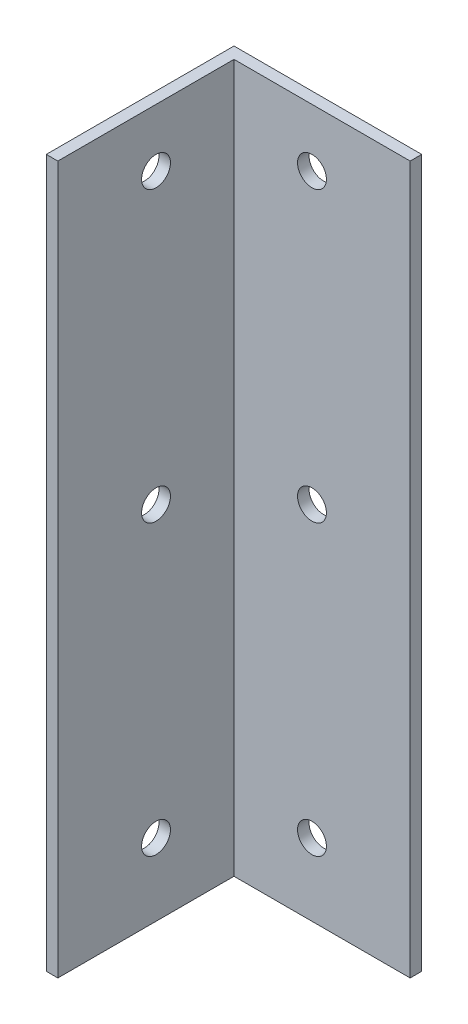
ISO-10303-21;
HEADER;
FILE_DESCRIPTION(('STEP AP214'),'2;1');
FILE_NAME('part.step','',(''),(''),'','','');
FILE_SCHEMA(('AUTOMOTIVE_DESIGN { 1 0 10303 214 1 1 1 1 }'));
ENDSEC;
DATA;
#1=APPLICATION_CONTEXT('core data for automotive mechanical design processes');
#2=APPLICATION_PROTOCOL_DEFINITION('international standard','automotive_design',2000,#1);
#3=PRODUCT_CONTEXT('',#1,'mechanical');
#4=PRODUCT('Part','Part','',(#3));
#5=PRODUCT_RELATED_PRODUCT_CATEGORY('part','',(#4));
#6=PRODUCT_DEFINITION_FORMATION('','',#4);
#7=PRODUCT_DEFINITION_CONTEXT('part definition',#1,'design');
#8=PRODUCT_DEFINITION('design','',#6,#7);
#9=PRODUCT_DEFINITION_SHAPE('','',#8);
#10=(LENGTH_UNIT() NAMED_UNIT(*) SI_UNIT(.MILLI.,.METRE.));
#11=(NAMED_UNIT(*) PLANE_ANGLE_UNIT() SI_UNIT($,.RADIAN.));
#12=(NAMED_UNIT(*) SI_UNIT($,.STERADIAN.) SOLID_ANGLE_UNIT());
#13=UNCERTAINTY_MEASURE_WITH_UNIT(LENGTH_MEASURE(1.E-05),#10,'distance_accuracy_value','');
#14=(GEOMETRIC_REPRESENTATION_CONTEXT(3) GLOBAL_UNCERTAINTY_ASSIGNED_CONTEXT((#13)) GLOBAL_UNIT_ASSIGNED_CONTEXT((#10,
#11,#12)) REPRESENTATION_CONTEXT('',''));
#15=CARTESIAN_POINT('',(0.,0.,0.));
#16=DIRECTION('',(0.,0.,1.));
#17=DIRECTION('',(1.,0.,0.));
#18=AXIS2_PLACEMENT_3D('',#15,#16,#17);
#19=CARTESIAN_POINT('',(4.,245.,0.));
#20=DIRECTION('',(-1.,0.,0.));
#21=DIRECTION('',(0.,0.,-1.));
#22=AXIS2_PLACEMENT_3D('',#19,#20,#21);
#23=PLANE('',#22);
#24=CARTESIAN_POINT('',(4.,125.,30.9999999999961));
#25=DIRECTION('',(1.,0.,0.));
#26=DIRECTION('',(0.,0.,-1.));
#27=AXIS2_PLACEMENT_3D('',#24,#25,#26);
#28=CIRCLE('',#27,4.99999999999999);
#29=CARTESIAN_POINT('',(4.,125.,25.9999999999961));
#30=VERTEX_POINT('',#29);
#31=EDGE_CURVE('E189',#30,#30,#28,.T.);
#32=ORIENTED_EDGE('',*,*,#31,.F.);
#33=EDGE_LOOP('',(#32));
#34=FACE_BOUND('',#33,.T.);
#35=CARTESIAN_POINT('',(4.,25.,30.9999999999922));
#36=DIRECTION('',(1.,0.,0.));
#37=DIRECTION('',(0.,0.,-1.));
#38=AXIS2_PLACEMENT_3D('',#35,#36,#37);
#39=CIRCLE('',#38,5.);
#40=CARTESIAN_POINT('',(4.,25.,25.9999999999922));
#41=VERTEX_POINT('',#40);
#42=EDGE_CURVE('E193',#41,#41,#39,.T.);
#43=ORIENTED_EDGE('',*,*,#42,.F.);
#44=EDGE_LOOP('',(#43));
#45=FACE_BOUND('',#44,.T.);
#46=CARTESIAN_POINT('',(4.,225.,31.));
#47=DIRECTION('',(1.,0.,0.));
#48=DIRECTION('',(0.,0.,-1.));
#49=AXIS2_PLACEMENT_3D('',#46,#47,#48);
#50=CIRCLE('',#49,5.);
#51=CARTESIAN_POINT('',(4.,225.,26.));
#52=VERTEX_POINT('',#51);
#53=EDGE_CURVE('E153',#52,#52,#50,.T.);
#54=ORIENTED_EDGE('',*,*,#53,.F.);
#55=EDGE_LOOP('',(#54));
#56=FACE_BOUND('',#55,.T.);
#57=DIRECTION('',(0.,0.,1.));
#58=VECTOR('',#57,1.);
#59=CARTESIAN_POINT('',(4.,0.,0.));
#60=LINE('',#59,#58);
#61=CARTESIAN_POINT('',(4.,0.,4.));
#62=VERTEX_POINT('',#61);
#63=CARTESIAN_POINT('',(4.,0.,65.));
#64=VERTEX_POINT('',#63);
#65=EDGE_CURVE('E122',#62,#64,#60,.T.);
#66=ORIENTED_EDGE('',*,*,#65,.F.);
#67=DIRECTION('',(0.,-1.,0.));
#68=VECTOR('',#67,1.);
#69=CARTESIAN_POINT('',(4.,245.,4.));
#70=LINE('',#69,#68);
#71=CARTESIAN_POINT('',(4.,245.,4.));
#72=VERTEX_POINT('',#71);
#73=EDGE_CURVE('E121',#72,#62,#70,.T.);
#74=ORIENTED_EDGE('',*,*,#73,.F.);
#75=DIRECTION('',(0.,0.,1.));
#76=VECTOR('',#75,1.);
#77=CARTESIAN_POINT('',(4.,245.,0.));
#78=LINE('',#77,#76);
#79=CARTESIAN_POINT('',(4.,245.,65.));
#80=VERTEX_POINT('',#79);
#81=EDGE_CURVE('E133',#72,#80,#78,.T.);
#82=ORIENTED_EDGE('',*,*,#81,.T.);
#83=DIRECTION('',(0.,-1.,0.));
#84=VECTOR('',#83,1.);
#85=CARTESIAN_POINT('',(4.,245.,65.));
#86=LINE('',#85,#84);
#87=EDGE_CURVE('E11',#80,#64,#86,.T.);
#88=ORIENTED_EDGE('',*,*,#87,.T.);
#89=EDGE_LOOP('',(#66,#74,#82,#88));
#90=FACE_BOUND('',#89,.T.);
#91=ADVANCED_FACE('F37',(#34,#45,#56,#90),#23,.F.);
#92=CARTESIAN_POINT('',(0.,245.,65.));
#93=DIRECTION('',(0.,0.,1.));
#94=DIRECTION('',(-1.,0.,0.));
#95=AXIS2_PLACEMENT_3D('',#92,#93,#94);
#96=PLANE('',#95);
#97=DIRECTION('',(1.,0.,0.));
#98=VECTOR('',#97,1.);
#99=CARTESIAN_POINT('',(0.,0.,65.));
#100=LINE('',#99,#98);
#101=CARTESIAN_POINT('',(0.,0.,65.));
#102=VERTEX_POINT('',#101);
#103=EDGE_CURVE('E124',#102,#64,#100,.T.);
#104=ORIENTED_EDGE('',*,*,#103,.T.);
#105=ORIENTED_EDGE('',*,*,#87,.F.);
#106=DIRECTION('',(1.,0.,0.));
#107=VECTOR('',#106,1.);
#108=CARTESIAN_POINT('',(0.,245.,65.));
#109=LINE('',#108,#107);
#110=CARTESIAN_POINT('',(0.,245.,65.));
#111=VERTEX_POINT('',#110);
#112=EDGE_CURVE('E87',#111,#80,#109,.T.);
#113=ORIENTED_EDGE('',*,*,#112,.F.);
#114=DIRECTION('',(0.,-1.,0.));
#115=VECTOR('',#114,1.);
#116=CARTESIAN_POINT('',(0.,245.,65.));
#117=LINE('',#116,#115);
#118=EDGE_CURVE('E46',#111,#102,#117,.T.);
#119=ORIENTED_EDGE('',*,*,#118,.T.);
#120=EDGE_LOOP('',(#104,#105,#113,#119));
#121=FACE_BOUND('',#120,.T.);
#122=ADVANCED_FACE('F179',(#121),#96,.T.);
#123=CARTESIAN_POINT('',(0.,245.,0.));
#124=DIRECTION('',(-1.,0.,0.));
#125=DIRECTION('',(0.,0.,-1.));
#126=AXIS2_PLACEMENT_3D('',#123,#124,#125);
#127=PLANE('',#126);
#128=CARTESIAN_POINT('',(0.,125.,30.9999999999961));
#129=DIRECTION('',(1.,0.,0.));
#130=DIRECTION('',(0.,0.,-1.));
#131=AXIS2_PLACEMENT_3D('',#128,#129,#130);
#132=CIRCLE('',#131,4.99999999999999);
#133=CARTESIAN_POINT('',(0.,125.,25.9999999999961));
#134=VERTEX_POINT('',#133);
#135=EDGE_CURVE('E204',#134,#134,#132,.T.);
#136=ORIENTED_EDGE('',*,*,#135,.T.);
#137=EDGE_LOOP('',(#136));
#138=FACE_BOUND('',#137,.T.);
#139=CARTESIAN_POINT('',(0.,25.,30.9999999999922));
#140=DIRECTION('',(1.,0.,0.));
#141=DIRECTION('',(0.,0.,-1.));
#142=AXIS2_PLACEMENT_3D('',#139,#140,#141);
#143=CIRCLE('',#142,5.);
#144=CARTESIAN_POINT('',(0.,25.,25.9999999999922));
#145=VERTEX_POINT('',#144);
#146=EDGE_CURVE('E205',#145,#145,#143,.T.);
#147=ORIENTED_EDGE('',*,*,#146,.T.);
#148=EDGE_LOOP('',(#147));
#149=FACE_BOUND('',#148,.T.);
#150=CARTESIAN_POINT('',(0.,225.,31.));
#151=DIRECTION('',(1.,0.,0.));
#152=DIRECTION('',(0.,0.,-1.));
#153=AXIS2_PLACEMENT_3D('',#150,#151,#152);
#154=CIRCLE('',#153,5.);
#155=CARTESIAN_POINT('',(0.,225.,26.));
#156=VERTEX_POINT('',#155);
#157=EDGE_CURVE('E197',#156,#156,#154,.T.);
#158=ORIENTED_EDGE('',*,*,#157,.T.);
#159=EDGE_LOOP('',(#158));
#160=FACE_BOUND('',#159,.T.);
#161=DIRECTION('',(0.,0.,1.));
#162=VECTOR('',#161,1.);
#163=CARTESIAN_POINT('',(0.,0.,0.));
#164=LINE('',#163,#162);
#165=CARTESIAN_POINT('',(0.,0.,0.));
#166=VERTEX_POINT('',#165);
#167=EDGE_CURVE('E127',#166,#102,#164,.T.);
#168=ORIENTED_EDGE('',*,*,#167,.T.);
#169=ORIENTED_EDGE('',*,*,#118,.F.);
#170=DIRECTION('',(0.,0.,1.));
#171=VECTOR('',#170,1.);
#172=CARTESIAN_POINT('',(0.,245.,0.));
#173=LINE('',#172,#171);
#174=CARTESIAN_POINT('',(0.,245.,0.));
#175=VERTEX_POINT('',#174);
#176=EDGE_CURVE('E115',#175,#111,#173,.T.);
#177=ORIENTED_EDGE('',*,*,#176,.F.);
#178=DIRECTION('',(0.,-1.,0.));
#179=VECTOR('',#178,1.);
#180=CARTESIAN_POINT('',(0.,245.,0.));
#181=LINE('',#180,#179);
#182=EDGE_CURVE('E109',#175,#166,#181,.T.);
#183=ORIENTED_EDGE('',*,*,#182,.T.);
#184=EDGE_LOOP('',(#168,#169,#177,#183));
#185=FACE_BOUND('',#184,.T.);
#186=ADVANCED_FACE('F184',(#138,#149,#160,#185),#127,.T.);
#187=CARTESIAN_POINT('',(0.,245.,0.));
#188=DIRECTION('',(0.,0.,-1.));
#189=DIRECTION('',(1.,0.,0.));
#190=AXIS2_PLACEMENT_3D('',#187,#188,#189);
#191=PLANE('',#190);
#192=CARTESIAN_POINT('',(31.0000000000039,125.,0.));
#193=DIRECTION('',(0.,0.,1.));
#194=DIRECTION('',(1.,0.,0.));
#195=AXIS2_PLACEMENT_3D('',#192,#193,#194);
#196=CIRCLE('',#195,5.00000000000001);
#197=CARTESIAN_POINT('',(36.0000000000039,125.,0.));
#198=VERTEX_POINT('',#197);
#199=EDGE_CURVE('E143',#198,#198,#196,.T.);
#200=ORIENTED_EDGE('',*,*,#199,.T.);
#201=EDGE_LOOP('',(#200));
#202=FACE_BOUND('',#201,.T.);
#203=CARTESIAN_POINT('',(31.0000000000078,25.,0.));
#204=DIRECTION('',(0.,0.,1.));
#205=DIRECTION('',(1.,0.,0.));
#206=AXIS2_PLACEMENT_3D('',#203,#204,#205);
#207=CIRCLE('',#206,5.);
#208=CARTESIAN_POINT('',(36.0000000000078,25.,0.));
#209=VERTEX_POINT('',#208);
#210=EDGE_CURVE('E148',#209,#209,#207,.T.);
#211=ORIENTED_EDGE('',*,*,#210,.T.);
#212=EDGE_LOOP('',(#211));
#213=FACE_BOUND('',#212,.T.);
#214=CARTESIAN_POINT('',(31.,225.,0.));
#215=DIRECTION('',(0.,0.,1.));
#216=DIRECTION('',(1.,0.,0.));
#217=AXIS2_PLACEMENT_3D('',#214,#215,#216);
#218=CIRCLE('',#217,5.);
#219=CARTESIAN_POINT('',(36.,225.,0.));
#220=VERTEX_POINT('',#219);
#221=EDGE_CURVE('E140',#220,#220,#218,.T.);
#222=ORIENTED_EDGE('',*,*,#221,.T.);
#223=EDGE_LOOP('',(#222));
#224=FACE_BOUND('',#223,.T.);
#225=DIRECTION('',(-1.,0.,0.));
#226=VECTOR('',#225,1.);
#227=CARTESIAN_POINT('',(0.,0.,0.));
#228=LINE('',#227,#226);
#229=CARTESIAN_POINT('',(65.,0.,0.));
#230=VERTEX_POINT('',#229);
#231=EDGE_CURVE('E129',#230,#166,#228,.T.);
#232=ORIENTED_EDGE('',*,*,#231,.T.);
#233=ORIENTED_EDGE('',*,*,#182,.F.);
#234=DIRECTION('',(-1.,0.,0.));
#235=VECTOR('',#234,1.);
#236=CARTESIAN_POINT('',(0.,245.,0.));
#237=LINE('',#236,#235);
#238=CARTESIAN_POINT('',(65.,245.,0.));
#239=VERTEX_POINT('',#238);
#240=EDGE_CURVE('E99',#239,#175,#237,.T.);
#241=ORIENTED_EDGE('',*,*,#240,.F.);
#242=DIRECTION('',(0.,-1.,0.));
#243=VECTOR('',#242,1.);
#244=CARTESIAN_POINT('',(65.,245.,0.));
#245=LINE('',#244,#243);
#246=EDGE_CURVE('E104',#239,#230,#245,.T.);
#247=ORIENTED_EDGE('',*,*,#246,.T.);
#248=EDGE_LOOP('',(#232,#233,#241,#247));
#249=FACE_BOUND('',#248,.T.);
#250=ADVANCED_FACE('F112',(#202,#213,#224,#249),#191,.T.);
#251=CARTESIAN_POINT('',(65.,245.,4.));
#252=DIRECTION('',(1.,0.,0.));
#253=DIRECTION('',(0.,0.,1.));
#254=AXIS2_PLACEMENT_3D('',#251,#252,#253);
#255=PLANE('',#254);
#256=DIRECTION('',(0.,0.,-1.));
#257=VECTOR('',#256,1.);
#258=CARTESIAN_POINT('',(65.,0.,4.));
#259=LINE('',#258,#257);
#260=CARTESIAN_POINT('',(65.,0.,4.));
#261=VERTEX_POINT('',#260);
#262=EDGE_CURVE('E106',#261,#230,#259,.T.);
#263=ORIENTED_EDGE('',*,*,#262,.T.);
#264=ORIENTED_EDGE('',*,*,#246,.F.);
#265=DIRECTION('',(0.,0.,-1.));
#266=VECTOR('',#265,1.);
#267=CARTESIAN_POINT('',(65.,245.,4.));
#268=LINE('',#267,#266);
#269=CARTESIAN_POINT('',(65.,245.,4.));
#270=VERTEX_POINT('',#269);
#271=EDGE_CURVE('E95',#270,#239,#268,.T.);
#272=ORIENTED_EDGE('',*,*,#271,.F.);
#273=DIRECTION('',(0.,-1.,0.));
#274=VECTOR('',#273,1.);
#275=CARTESIAN_POINT('',(65.,245.,4.));
#276=LINE('',#275,#274);
#277=EDGE_CURVE('E110',#270,#261,#276,.T.);
#278=ORIENTED_EDGE('',*,*,#277,.T.);
#279=EDGE_LOOP('',(#263,#264,#272,#278));
#280=FACE_BOUND('',#279,.T.);
#281=ADVANCED_FACE('F105',(#280),#255,.T.);
#282=CARTESIAN_POINT('',(0.,245.,4.));
#283=DIRECTION('',(0.,0.,-1.));
#284=DIRECTION('',(1.,0.,0.));
#285=AXIS2_PLACEMENT_3D('',#282,#283,#284);
#286=PLANE('',#285);
#287=CARTESIAN_POINT('',(31.0000000000039,125.,4.));
#288=DIRECTION('',(0.,0.,1.));
#289=DIRECTION('',(1.,0.,0.));
#290=AXIS2_PLACEMENT_3D('',#287,#288,#289);
#291=CIRCLE('',#290,5.00000000000001);
#292=CARTESIAN_POINT('',(36.0000000000039,125.,4.));
#293=VERTEX_POINT('',#292);
#294=EDGE_CURVE('E40',#293,#293,#291,.T.);
#295=ORIENTED_EDGE('',*,*,#294,.F.);
#296=EDGE_LOOP('',(#295));
#297=FACE_BOUND('',#296,.T.);
#298=CARTESIAN_POINT('',(31.0000000000078,25.,4.));
#299=DIRECTION('',(0.,0.,1.));
#300=DIRECTION('',(1.,0.,0.));
#301=AXIS2_PLACEMENT_3D('',#298,#299,#300);
#302=CIRCLE('',#301,5.);
#303=CARTESIAN_POINT('',(36.0000000000078,25.,4.));
#304=VERTEX_POINT('',#303);
#305=EDGE_CURVE('E141',#304,#304,#302,.T.);
#306=ORIENTED_EDGE('',*,*,#305,.F.);
#307=EDGE_LOOP('',(#306));
#308=FACE_BOUND('',#307,.T.);
#309=CARTESIAN_POINT('',(31.,225.,4.));
#310=DIRECTION('',(0.,0.,1.));
#311=DIRECTION('',(1.,0.,0.));
#312=AXIS2_PLACEMENT_3D('',#309,#310,#311);
#313=CIRCLE('',#312,5.);
#314=CARTESIAN_POINT('',(36.,225.,4.));
#315=VERTEX_POINT('',#314);
#316=EDGE_CURVE('E125',#315,#315,#313,.T.);
#317=ORIENTED_EDGE('',*,*,#316,.F.);
#318=EDGE_LOOP('',(#317));
#319=FACE_BOUND('',#318,.T.);
#320=DIRECTION('',(1.,0.,0.));
#321=VECTOR('',#320,1.);
#322=CARTESIAN_POINT('',(0.,0.,4.));
#323=LINE('',#322,#321);
#324=EDGE_CURVE('E75',#261,#62,#323,.F.);
#325=ORIENTED_EDGE('',*,*,#324,.F.);
#326=ORIENTED_EDGE('',*,*,#277,.F.);
#327=DIRECTION('',(1.,0.,0.));
#328=VECTOR('',#327,1.);
#329=CARTESIAN_POINT('',(0.,245.,4.));
#330=LINE('',#329,#328);
#331=EDGE_CURVE('E55',#270,#72,#330,.F.);
#332=ORIENTED_EDGE('',*,*,#331,.T.);
#333=ORIENTED_EDGE('',*,*,#73,.T.);
#334=EDGE_LOOP('',(#325,#326,#332,#333));
#335=FACE_BOUND('',#334,.T.);
#336=ADVANCED_FACE('F164',(#297,#308,#319,#335),#286,.F.);
#337=CARTESIAN_POINT('',(0.,245.,0.));
#338=DIRECTION('',(0.,-1.,0.));
#339=DIRECTION('',(-1.,0.,0.));
#340=AXIS2_PLACEMENT_3D('',#337,#338,#339);
#341=PLANE('',#340);
#342=ORIENTED_EDGE('',*,*,#81,.F.);
#343=ORIENTED_EDGE('',*,*,#331,.F.);
#344=ORIENTED_EDGE('',*,*,#271,.T.);
#345=ORIENTED_EDGE('',*,*,#240,.T.);
#346=ORIENTED_EDGE('',*,*,#176,.T.);
#347=ORIENTED_EDGE('',*,*,#112,.T.);
#348=EDGE_LOOP('',(#342,#343,#344,#345,#346,#347));
#349=FACE_BOUND('',#348,.T.);
#350=ADVANCED_FACE('F97',(#349),#341,.F.);
#351=CARTESIAN_POINT('',(0.,0.,0.));
#352=DIRECTION('',(0.,-1.,0.));
#353=DIRECTION('',(-1.,0.,0.));
#354=AXIS2_PLACEMENT_3D('',#351,#352,#353);
#355=PLANE('',#354);
#356=ORIENTED_EDGE('',*,*,#65,.T.);
#357=ORIENTED_EDGE('',*,*,#103,.F.);
#358=ORIENTED_EDGE('',*,*,#167,.F.);
#359=ORIENTED_EDGE('',*,*,#231,.F.);
#360=ORIENTED_EDGE('',*,*,#262,.F.);
#361=ORIENTED_EDGE('',*,*,#324,.T.);
#362=EDGE_LOOP('',(#356,#357,#358,#359,#360,#361));
#363=FACE_BOUND('',#362,.T.);
#364=ADVANCED_FACE('F172',(#363),#355,.T.);
#365=CARTESIAN_POINT('',(31.,225.,10.));
#366=DIRECTION('',(0.,0.,-1.));
#367=DIRECTION('',(1.,0.,0.));
#368=AXIS2_PLACEMENT_3D('',#365,#366,#367);
#369=CYLINDRICAL_SURFACE('',#368,5.);
#370=ORIENTED_EDGE('',*,*,#221,.F.);
#371=EDGE_LOOP('',(#370));
#372=FACE_BOUND('',#371,.T.);
#373=ORIENTED_EDGE('',*,*,#316,.T.);
#374=EDGE_LOOP('',(#373));
#375=FACE_BOUND('',#374,.T.);
#376=ADVANCED_FACE('F235',(#372,#375),#369,.F.);
#377=CARTESIAN_POINT('',(31.0000000000078,25.,10.));
#378=DIRECTION('',(0.,0.,-1.));
#379=DIRECTION('',(1.,0.,0.));
#380=AXIS2_PLACEMENT_3D('',#377,#378,#379);
#381=CYLINDRICAL_SURFACE('',#380,5.);
#382=ORIENTED_EDGE('',*,*,#210,.F.);
#383=EDGE_LOOP('',(#382));
#384=FACE_BOUND('',#383,.T.);
#385=ORIENTED_EDGE('',*,*,#305,.T.);
#386=EDGE_LOOP('',(#385));
#387=FACE_BOUND('',#386,.T.);
#388=ADVANCED_FACE('F231',(#384,#387),#381,.F.);
#389=CARTESIAN_POINT('',(31.0000000000039,125.,10.));
#390=DIRECTION('',(0.,0.,-1.));
#391=DIRECTION('',(1.,0.,0.));
#392=AXIS2_PLACEMENT_3D('',#389,#390,#391);
#393=CYLINDRICAL_SURFACE('',#392,5.00000000000001);
#394=ORIENTED_EDGE('',*,*,#199,.F.);
#395=EDGE_LOOP('',(#394));
#396=FACE_BOUND('',#395,.T.);
#397=ORIENTED_EDGE('',*,*,#294,.T.);
#398=EDGE_LOOP('',(#397));
#399=FACE_BOUND('',#398,.T.);
#400=ADVANCED_FACE('F227',(#396,#399),#393,.F.);
#401=CARTESIAN_POINT('',(10.,225.,31.));
#402=DIRECTION('',(-1.,0.,0.));
#403=DIRECTION('',(0.,0.,-1.));
#404=AXIS2_PLACEMENT_3D('',#401,#402,#403);
#405=CYLINDRICAL_SURFACE('',#404,5.);
#406=ORIENTED_EDGE('',*,*,#157,.F.);
#407=EDGE_LOOP('',(#406));
#408=FACE_BOUND('',#407,.T.);
#409=ORIENTED_EDGE('',*,*,#53,.T.);
#410=EDGE_LOOP('',(#409));
#411=FACE_BOUND('',#410,.T.);
#412=ADVANCED_FACE('F221',(#408,#411),#405,.F.);
#413=CARTESIAN_POINT('',(10.,25.,30.9999999999922));
#414=DIRECTION('',(-1.,0.,0.));
#415=DIRECTION('',(0.,0.,-1.));
#416=AXIS2_PLACEMENT_3D('',#413,#414,#415);
#417=CYLINDRICAL_SURFACE('',#416,5.);
#418=ORIENTED_EDGE('',*,*,#146,.F.);
#419=EDGE_LOOP('',(#418));
#420=FACE_BOUND('',#419,.T.);
#421=ORIENTED_EDGE('',*,*,#42,.T.);
#422=EDGE_LOOP('',(#421));
#423=FACE_BOUND('',#422,.T.);
#424=ADVANCED_FACE('F216',(#420,#423),#417,.F.);
#425=CARTESIAN_POINT('',(10.,125.,30.9999999999961));
#426=DIRECTION('',(-1.,0.,0.));
#427=DIRECTION('',(0.,0.,-1.));
#428=AXIS2_PLACEMENT_3D('',#425,#426,#427);
#429=CYLINDRICAL_SURFACE('',#428,4.99999999999999);
#430=ORIENTED_EDGE('',*,*,#135,.F.);
#431=EDGE_LOOP('',(#430));
#432=FACE_BOUND('',#431,.T.);
#433=ORIENTED_EDGE('',*,*,#31,.T.);
#434=EDGE_LOOP('',(#433));
#435=FACE_BOUND('',#434,.T.);
#436=ADVANCED_FACE('F213',(#432,#435),#429,.F.);
#437=CLOSED_SHELL('',(#91,#122,#186,#250,#281,#336,#350,#364,#376,#388,#400,#412,#424,#436));
#438=MANIFOLD_SOLID_BREP('B2',#437);
#439=ADVANCED_BREP_SHAPE_REPRESENTATION('',(#18,#438),#14);
#440=SHAPE_DEFINITION_REPRESENTATION(#9,#439);
ENDSEC;
END-ISO-10303-21;
